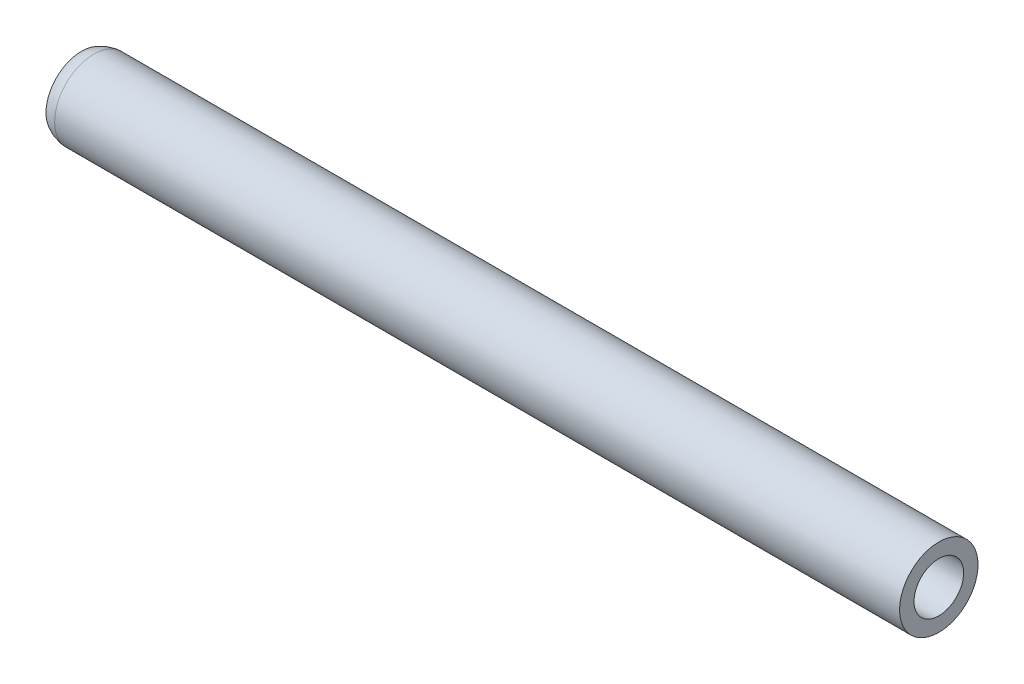
ISO-10303-21;
HEADER;
FILE_DESCRIPTION(('STEP AP214'),'2;1');
FILE_NAME('part.step','',(''),(''),'','','');
FILE_SCHEMA(('AUTOMOTIVE_DESIGN { 1 0 10303 214 1 1 1 1 }'));
ENDSEC;
DATA;
#1=APPLICATION_CONTEXT('core data for automotive mechanical design processes');
#2=APPLICATION_PROTOCOL_DEFINITION('international standard','automotive_design',2000,#1);
#3=PRODUCT_CONTEXT('',#1,'mechanical');
#4=PRODUCT('Part','Part','',(#3));
#5=PRODUCT_RELATED_PRODUCT_CATEGORY('part','',(#4));
#6=PRODUCT_DEFINITION_FORMATION('','',#4);
#7=PRODUCT_DEFINITION_CONTEXT('part definition',#1,'design');
#8=PRODUCT_DEFINITION('design','',#6,#7);
#9=PRODUCT_DEFINITION_SHAPE('','',#8);
#10=(LENGTH_UNIT() NAMED_UNIT(*) SI_UNIT(.MILLI.,.METRE.));
#11=(NAMED_UNIT(*) PLANE_ANGLE_UNIT() SI_UNIT($,.RADIAN.));
#12=(NAMED_UNIT(*) SI_UNIT($,.STERADIAN.) SOLID_ANGLE_UNIT());
#13=UNCERTAINTY_MEASURE_WITH_UNIT(LENGTH_MEASURE(1.E-05),#10,'distance_accuracy_value','');
#14=(GEOMETRIC_REPRESENTATION_CONTEXT(3) GLOBAL_UNCERTAINTY_ASSIGNED_CONTEXT((#13)) GLOBAL_UNIT_ASSIGNED_CONTEXT((#10,
#11,#12)) REPRESENTATION_CONTEXT('',''));
#15=CARTESIAN_POINT('',(0.,0.,0.));
#16=DIRECTION('',(0.,0.,1.));
#17=DIRECTION('',(1.,0.,0.));
#18=AXIS2_PLACEMENT_3D('',#15,#16,#17);
#19=CARTESIAN_POINT('',(-177.8,0.,0.));
#20=DIRECTION('',(1.,0.,0.));
#21=DIRECTION('',(0.,0.,-1.));
#22=AXIS2_PLACEMENT_3D('',#19,#20,#21);
#23=CYLINDRICAL_SURFACE('',#22,16.256);
#24=CARTESIAN_POINT('',(177.8,0.,0.));
#25=DIRECTION('',(1.,0.,0.));
#26=DIRECTION('',(0.,0.,-1.));
#27=AXIS2_PLACEMENT_3D('',#24,#25,#26);
#28=CIRCLE('',#27,16.256);
#29=CARTESIAN_POINT('',(177.8,0.,-16.256));
#30=VERTEX_POINT('',#29);
#31=EDGE_CURVE('E50',#30,#30,#28,.T.);
#32=ORIENTED_EDGE('',*,*,#31,.F.);
#33=EDGE_LOOP('',(#32));
#34=FACE_BOUND('',#33,.T.);
#35=CARTESIAN_POINT('',(-172.687403520768,0.,0.));
#36=DIRECTION('',(-1.,0.,0.));
#37=DIRECTION('',(0.,0.,1.));
#38=AXIS2_PLACEMENT_3D('',#35,#36,#37);
#39=CIRCLE('',#38,16.256);
#40=CARTESIAN_POINT('',(-172.687403520768,0.,16.256));
#41=VERTEX_POINT('',#40);
#42=EDGE_CURVE('E66',#41,#41,#39,.T.);
#43=ORIENTED_EDGE('',*,*,#42,.F.);
#44=EDGE_LOOP('',(#43));
#45=FACE_BOUND('',#44,.T.);
#46=ADVANCED_FACE('F43',(#34,#45),#23,.T.);
#47=CARTESIAN_POINT('',(-177.8,0.,0.));
#48=DIRECTION('',(1.,0.,0.));
#49=DIRECTION('',(0.,0.,-1.));
#50=AXIS2_PLACEMENT_3D('',#47,#48,#49);
#51=PLANE('',#50);
#52=CARTESIAN_POINT('',(-177.8,0.,0.));
#53=DIRECTION('',(1.,0.,0.));
#54=DIRECTION('',(0.,0.,-1.));
#55=AXIS2_PLACEMENT_3D('',#52,#53,#54);
#56=CIRCLE('',#55,10.287);
#57=CARTESIAN_POINT('',(-177.8,0.,-10.287));
#58=VERTEX_POINT('',#57);
#59=EDGE_CURVE('E10',#58,#58,#56,.T.);
#60=ORIENTED_EDGE('',*,*,#59,.T.);
#61=EDGE_LOOP('',(#60));
#62=FACE_BOUND('',#61,.T.);
#63=CARTESIAN_POINT('',(-177.8,0.,0.));
#64=DIRECTION('',(-1.,0.,0.));
#65=DIRECTION('',(0.,0.,1.));
#66=AXIS2_PLACEMENT_3D('',#63,#64,#65);
#67=CIRCLE('',#66,14.732);
#68=CARTESIAN_POINT('',(-177.8,0.,14.732));
#69=VERTEX_POINT('',#68);
#70=EDGE_CURVE('E60',#69,#69,#67,.T.);
#71=ORIENTED_EDGE('',*,*,#70,.T.);
#72=EDGE_LOOP('',(#71));
#73=FACE_BOUND('',#72,.T.);
#74=ADVANCED_FACE('F75',(#62,#73),#51,.F.);
#75=CARTESIAN_POINT('',(-177.8,0.,0.));
#76=DIRECTION('',(1.,0.,0.));
#77=DIRECTION('',(0.,0.,-1.));
#78=AXIS2_PLACEMENT_3D('',#75,#76,#77);
#79=CYLINDRICAL_SURFACE('',#78,10.287);
#80=ORIENTED_EDGE('',*,*,#59,.F.);
#81=EDGE_LOOP('',(#80));
#82=FACE_BOUND('',#81,.T.);
#83=CARTESIAN_POINT('',(177.8,0.,0.));
#84=DIRECTION('',(1.,0.,0.));
#85=DIRECTION('',(0.,0.,-1.));
#86=AXIS2_PLACEMENT_3D('',#83,#84,#85);
#87=CIRCLE('',#86,10.287);
#88=CARTESIAN_POINT('',(177.8,0.,-10.287));
#89=VERTEX_POINT('',#88);
#90=EDGE_CURVE('E55',#89,#89,#87,.T.);
#91=ORIENTED_EDGE('',*,*,#90,.T.);
#92=EDGE_LOOP('',(#91));
#93=FACE_BOUND('',#92,.T.);
#94=ADVANCED_FACE('F80',(#82,#93),#79,.F.);
#95=CARTESIAN_POINT('',(177.8,0.,0.));
#96=DIRECTION('',(1.,0.,0.));
#97=DIRECTION('',(0.,0.,-1.));
#98=AXIS2_PLACEMENT_3D('',#95,#96,#97);
#99=PLANE('',#98);
#100=ORIENTED_EDGE('',*,*,#31,.T.);
#101=EDGE_LOOP('',(#100));
#102=FACE_BOUND('',#101,.T.);
#103=ORIENTED_EDGE('',*,*,#90,.F.);
#104=EDGE_LOOP('',(#103));
#105=FACE_BOUND('',#104,.T.);
#106=ADVANCED_FACE('F84',(#102,#105),#99,.T.);
#107=CARTESIAN_POINT('',(-172.068701760384,0.,0.));
#108=DIRECTION('',(-1.,0.,0.));
#109=DIRECTION('',(0.,0.,1.));
#110=AXIS2_PLACEMENT_3D('',#107,#108,#109);
#111=DEGENERATE_TOROIDAL_SURFACE('',#110,4.84275733493335,11.43,.T.);
#112=ORIENTED_EDGE('',*,*,#42,.T.);
#113=EDGE_LOOP('',(#112));
#114=FACE_BOUND('',#113,.T.);
#115=ORIENTED_EDGE('',*,*,#70,.F.);
#116=EDGE_LOOP('',(#115));
#117=FACE_BOUND('',#116,.T.);
#118=ADVANCED_FACE('F71',(#114,#117),#111,.T.);
#119=CLOSED_SHELL('',(#46,#74,#94,#106,#118));
#120=MANIFOLD_SOLID_BREP('B2',#119);
#121=ADVANCED_BREP_SHAPE_REPRESENTATION('',(#18,#120),#14);
#122=SHAPE_DEFINITION_REPRESENTATION(#9,#121);
ENDSEC;
END-ISO-10303-21;
